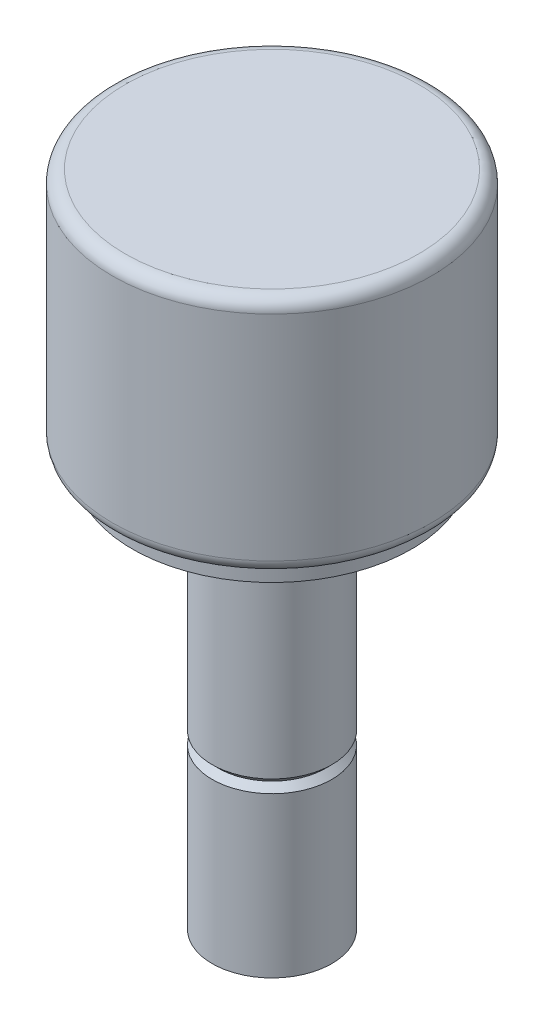
ISO-10303-21;
HEADER;
FILE_DESCRIPTION(('STEP AP214'),'2;1');
FILE_NAME('part.step','',(''),(''),'','','');
FILE_SCHEMA(('AUTOMOTIVE_DESIGN { 1 0 10303 214 1 1 1 1 }'));
ENDSEC;
DATA;
#1=APPLICATION_CONTEXT('core data for automotive mechanical design processes');
#2=APPLICATION_PROTOCOL_DEFINITION('international standard','automotive_design',2000,#1);
#3=PRODUCT_CONTEXT('',#1,'mechanical');
#4=PRODUCT('Part','Part','',(#3));
#5=PRODUCT_RELATED_PRODUCT_CATEGORY('part','',(#4));
#6=PRODUCT_DEFINITION_FORMATION('','',#4);
#7=PRODUCT_DEFINITION_CONTEXT('part definition',#1,'design');
#8=PRODUCT_DEFINITION('design','',#6,#7);
#9=PRODUCT_DEFINITION_SHAPE('','',#8);
#10=(LENGTH_UNIT() NAMED_UNIT(*) SI_UNIT(.MILLI.,.METRE.));
#11=(NAMED_UNIT(*) PLANE_ANGLE_UNIT() SI_UNIT($,.RADIAN.));
#12=(NAMED_UNIT(*) SI_UNIT($,.STERADIAN.) SOLID_ANGLE_UNIT());
#13=UNCERTAINTY_MEASURE_WITH_UNIT(LENGTH_MEASURE(1.E-05),#10,'distance_accuracy_value','');
#14=(GEOMETRIC_REPRESENTATION_CONTEXT(3) GLOBAL_UNCERTAINTY_ASSIGNED_CONTEXT((#13)) GLOBAL_UNIT_ASSIGNED_CONTEXT((#10,
#11,#12)) REPRESENTATION_CONTEXT('',''));
#15=CARTESIAN_POINT('',(0.,0.,0.));
#16=DIRECTION('',(0.,0.,1.));
#17=DIRECTION('',(1.,0.,0.));
#18=AXIS2_PLACEMENT_3D('',#15,#16,#17);
#19=CARTESIAN_POINT('',(0.,0.,0.));
#20=DIRECTION('',(0.,-1.,0.));
#21=DIRECTION('',(0.,0.,-1.));
#22=AXIS2_PLACEMENT_3D('',#19,#20,#21);
#23=PLANE('',#22);
#24=CARTESIAN_POINT('',(0.,0.,0.));
#25=DIRECTION('',(0.,-1.,0.));
#26=DIRECTION('',(0.,0.,-1.));
#27=AXIS2_PLACEMENT_3D('',#24,#25,#26);
#28=CIRCLE('',#27,2.38125);
#29=CARTESIAN_POINT('',(0.,0.,-2.38125));
#30=VERTEX_POINT('',#29);
#31=EDGE_CURVE('E50',#30,#30,#28,.T.);
#32=ORIENTED_EDGE('',*,*,#31,.T.);
#33=EDGE_LOOP('',(#32));
#34=FACE_BOUND('',#33,.T.);
#35=ADVANCED_FACE('F30',(#34),#23,.T.);
#36=CARTESIAN_POINT('',(0.,0.,0.));
#37=DIRECTION('',(0.,-1.,0.));
#38=DIRECTION('',(0.,0.,-1.));
#39=AXIS2_PLACEMENT_3D('',#36,#37,#38);
#40=CYLINDRICAL_SURFACE('',#39,2.38125);
#41=CARTESIAN_POINT('',(0.,6.35,0.));
#42=DIRECTION('',(0.,-1.,0.));
#43=DIRECTION('',(0.,0.,-1.));
#44=AXIS2_PLACEMENT_3D('',#41,#42,#43);
#45=CIRCLE('',#44,2.38125);
#46=CARTESIAN_POINT('',(0.,6.35,-2.38125));
#47=VERTEX_POINT('',#46);
#48=EDGE_CURVE('E53',#47,#47,#45,.T.);
#49=ORIENTED_EDGE('',*,*,#48,.T.);
#50=EDGE_LOOP('',(#49));
#51=FACE_BOUND('',#50,.T.);
#52=ORIENTED_EDGE('',*,*,#31,.F.);
#53=EDGE_LOOP('',(#52));
#54=FACE_BOUND('',#53,.T.);
#55=ADVANCED_FACE('F89',(#51,#54),#40,.T.);
#56=CARTESIAN_POINT('',(0.,6.35,0.));
#57=DIRECTION('',(0.,-1.,0.));
#58=DIRECTION('',(0.,0.,-1.));
#59=AXIS2_PLACEMENT_3D('',#56,#57,#58);
#60=CONICAL_SURFACE('',#59,2.38125,0.785398163397452);
#61=CARTESIAN_POINT('',(0.,6.604,0.));
#62=DIRECTION('',(0.,-1.,0.));
#63=DIRECTION('',(0.,0.,-1.));
#64=AXIS2_PLACEMENT_3D('',#61,#62,#63);
#65=CIRCLE('',#64,2.12725);
#66=CARTESIAN_POINT('',(0.,6.604,-2.12725));
#67=VERTEX_POINT('',#66);
#68=EDGE_CURVE('E56',#67,#67,#65,.T.);
#69=ORIENTED_EDGE('',*,*,#68,.T.);
#70=EDGE_LOOP('',(#69));
#71=FACE_BOUND('',#70,.T.);
#72=ORIENTED_EDGE('',*,*,#48,.F.);
#73=EDGE_LOOP('',(#72));
#74=FACE_BOUND('',#73,.T.);
#75=ADVANCED_FACE('F95',(#71,#74),#60,.T.);
#76=CARTESIAN_POINT('',(0.,6.604,0.));
#77=DIRECTION('',(0.,1.,0.));
#78=DIRECTION('',(0.,0.,1.));
#79=AXIS2_PLACEMENT_3D('',#76,#77,#78);
#80=CONICAL_SURFACE('',#79,2.12725,0.785398163397452);
#81=CARTESIAN_POINT('',(0.,6.858,0.));
#82=DIRECTION('',(0.,-1.,0.));
#83=DIRECTION('',(0.,0.,-1.));
#84=AXIS2_PLACEMENT_3D('',#81,#82,#83);
#85=CIRCLE('',#84,2.38125);
#86=CARTESIAN_POINT('',(0.,6.858,-2.38125));
#87=VERTEX_POINT('',#86);
#88=EDGE_CURVE('E59',#87,#87,#85,.T.);
#89=ORIENTED_EDGE('',*,*,#88,.T.);
#90=EDGE_LOOP('',(#89));
#91=FACE_BOUND('',#90,.T.);
#92=ORIENTED_EDGE('',*,*,#68,.F.);
#93=EDGE_LOOP('',(#92));
#94=FACE_BOUND('',#93,.T.);
#95=ADVANCED_FACE('F145',(#91,#94),#80,.T.);
#96=CARTESIAN_POINT('',(0.,0.,0.));
#97=DIRECTION('',(0.,-1.,0.));
#98=DIRECTION('',(0.,0.,-1.));
#99=AXIS2_PLACEMENT_3D('',#96,#97,#98);
#100=CYLINDRICAL_SURFACE('',#99,2.38125);
#101=CARTESIAN_POINT('',(0.,15.875,0.));
#102=DIRECTION('',(0.,-1.,0.));
#103=DIRECTION('',(0.,0.,-1.));
#104=AXIS2_PLACEMENT_3D('',#101,#102,#103);
#105=CIRCLE('',#104,2.38125);
#106=CARTESIAN_POINT('',(0.,15.875,-2.38125));
#107=VERTEX_POINT('',#106);
#108=EDGE_CURVE('E62',#107,#107,#105,.T.);
#109=ORIENTED_EDGE('',*,*,#108,.T.);
#110=EDGE_LOOP('',(#109));
#111=FACE_BOUND('',#110,.T.);
#112=ORIENTED_EDGE('',*,*,#88,.F.);
#113=EDGE_LOOP('',(#112));
#114=FACE_BOUND('',#113,.T.);
#115=ADVANCED_FACE('F135',(#111,#114),#100,.T.);
#116=CARTESIAN_POINT('',(2.38125,15.875,0.));
#117=DIRECTION('',(0.,-1.,0.));
#118=DIRECTION('',(0.,0.,-1.));
#119=AXIS2_PLACEMENT_3D('',#116,#117,#118);
#120=PLANE('',#119);
#121=CARTESIAN_POINT('',(0.,15.875,0.));
#122=DIRECTION('',(0.,-1.,0.));
#123=DIRECTION('',(0.,0.,-1.));
#124=AXIS2_PLACEMENT_3D('',#121,#122,#123);
#125=CIRCLE('',#124,5.55625);
#126=CARTESIAN_POINT('',(0.,15.875,-5.55625));
#127=VERTEX_POINT('',#126);
#128=EDGE_CURVE('E65',#127,#127,#125,.T.);
#129=ORIENTED_EDGE('',*,*,#128,.T.);
#130=EDGE_LOOP('',(#129));
#131=FACE_BOUND('',#130,.T.);
#132=ORIENTED_EDGE('',*,*,#108,.F.);
#133=EDGE_LOOP('',(#132));
#134=FACE_BOUND('',#133,.T.);
#135=ADVANCED_FACE('F86',(#131,#134),#120,.T.);
#136=CARTESIAN_POINT('',(0.,0.,0.));
#137=DIRECTION('',(0.,-1.,0.));
#138=DIRECTION('',(0.,0.,-1.));
#139=AXIS2_PLACEMENT_3D('',#136,#137,#138);
#140=CYLINDRICAL_SURFACE('',#139,5.55625);
#141=CARTESIAN_POINT('',(0.,16.66875,0.));
#142=DIRECTION('',(0.,-1.,0.));
#143=DIRECTION('',(0.,0.,-1.));
#144=AXIS2_PLACEMENT_3D('',#141,#142,#143);
#145=CIRCLE('',#144,5.55625);
#146=CARTESIAN_POINT('',(0.,16.66875,-5.55625));
#147=VERTEX_POINT('',#146);
#148=EDGE_CURVE('E68',#147,#147,#145,.T.);
#149=ORIENTED_EDGE('',*,*,#148,.T.);
#150=EDGE_LOOP('',(#149));
#151=FACE_BOUND('',#150,.T.);
#152=ORIENTED_EDGE('',*,*,#128,.F.);
#153=EDGE_LOOP('',(#152));
#154=FACE_BOUND('',#153,.T.);
#155=ADVANCED_FACE('F72',(#151,#154),#140,.T.);
#156=CARTESIAN_POINT('',(5.55625,16.66875,0.));
#157=DIRECTION('',(0.,-1.,0.));
#158=DIRECTION('',(0.,0.,-1.));
#159=AXIS2_PLACEMENT_3D('',#156,#157,#158);
#160=PLANE('',#159);
#161=CARTESIAN_POINT('',(0.,16.66875,0.));
#162=DIRECTION('',(0.,-1.,0.));
#163=DIRECTION('',(0.,0.,-1.));
#164=AXIS2_PLACEMENT_3D('',#161,#162,#163);
#165=CIRCLE('',#164,5.842);
#166=CARTESIAN_POINT('',(0.,16.66875,-5.842));
#167=VERTEX_POINT('',#166);
#168=EDGE_CURVE('E45',#167,#167,#165,.T.);
#169=ORIENTED_EDGE('',*,*,#168,.T.);
#170=EDGE_LOOP('',(#169));
#171=FACE_BOUND('',#170,.T.);
#172=ORIENTED_EDGE('',*,*,#148,.F.);
#173=EDGE_LOOP('',(#172));
#174=FACE_BOUND('',#173,.T.);
#175=ADVANCED_FACE('F75',(#171,#174),#160,.T.);
#176=CARTESIAN_POINT('',(0.,0.,0.));
#177=DIRECTION('',(0.,-1.,0.));
#178=DIRECTION('',(0.,0.,-1.));
#179=AXIS2_PLACEMENT_3D('',#176,#177,#178);
#180=CYLINDRICAL_SURFACE('',#179,6.35);
#181=CARTESIAN_POINT('',(0.,17.17675,0.));
#182=DIRECTION('',(0.,-1.,0.));
#183=DIRECTION('',(0.,0.,-1.));
#184=AXIS2_PLACEMENT_3D('',#181,#182,#183);
#185=CIRCLE('',#184,6.35);
#186=CARTESIAN_POINT('',(0.,17.17675,-6.35));
#187=VERTEX_POINT('',#186);
#188=EDGE_CURVE('E37',#187,#187,#185,.F.);
#189=ORIENTED_EDGE('',*,*,#188,.T.);
#190=EDGE_LOOP('',(#189));
#191=FACE_BOUND('',#190,.T.);
#192=CARTESIAN_POINT('',(0.,25.68575,0.));
#193=DIRECTION('',(0.,1.,0.));
#194=DIRECTION('',(0.,0.,1.));
#195=AXIS2_PLACEMENT_3D('',#192,#193,#194);
#196=CIRCLE('',#195,6.35);
#197=CARTESIAN_POINT('',(0.,25.68575,6.35));
#198=VERTEX_POINT('',#197);
#199=EDGE_CURVE('E41',#198,#198,#196,.F.);
#200=ORIENTED_EDGE('',*,*,#199,.T.);
#201=EDGE_LOOP('',(#200));
#202=FACE_BOUND('',#201,.T.);
#203=ADVANCED_FACE('F77',(#191,#202),#180,.T.);
#204=CARTESIAN_POINT('',(6.35,26.19375,0.));
#205=DIRECTION('',(0.,1.,0.));
#206=DIRECTION('',(0.,0.,1.));
#207=AXIS2_PLACEMENT_3D('',#204,#205,#206);
#208=PLANE('',#207);
#209=CARTESIAN_POINT('',(0.,26.19375,0.));
#210=DIRECTION('',(0.,1.,0.));
#211=DIRECTION('',(0.,0.,1.));
#212=AXIS2_PLACEMENT_3D('',#209,#210,#211);
#213=CIRCLE('',#212,5.842);
#214=CARTESIAN_POINT('',(0.,26.19375,5.842));
#215=VERTEX_POINT('',#214);
#216=EDGE_CURVE('E10',#215,#215,#213,.T.);
#217=ORIENTED_EDGE('',*,*,#216,.T.);
#218=EDGE_LOOP('',(#217));
#219=FACE_BOUND('',#218,.T.);
#220=ADVANCED_FACE('F84',(#219),#208,.T.);
#221=CARTESIAN_POINT('',(0.,17.17675,0.));
#222=DIRECTION('',(0.,-1.,0.));
#223=DIRECTION('',(0.,0.,-1.));
#224=AXIS2_PLACEMENT_3D('',#221,#222,#223);
#225=TOROIDAL_SURFACE('',#224,5.842,0.508);
#226=ORIENTED_EDGE('',*,*,#188,.F.);
#227=EDGE_LOOP('',(#226));
#228=FACE_BOUND('',#227,.T.);
#229=ORIENTED_EDGE('',*,*,#168,.F.);
#230=EDGE_LOOP('',(#229));
#231=FACE_BOUND('',#230,.T.);
#232=ADVANCED_FACE('F99',(#228,#231),#225,.T.);
#233=CARTESIAN_POINT('',(0.,25.68575,0.));
#234=DIRECTION('',(0.,1.,0.));
#235=DIRECTION('',(0.,0.,1.));
#236=AXIS2_PLACEMENT_3D('',#233,#234,#235);
#237=TOROIDAL_SURFACE('',#236,5.842,0.508);
#238=ORIENTED_EDGE('',*,*,#216,.F.);
#239=EDGE_LOOP('',(#238));
#240=FACE_BOUND('',#239,.T.);
#241=ORIENTED_EDGE('',*,*,#199,.F.);
#242=EDGE_LOOP('',(#241));
#243=FACE_BOUND('',#242,.T.);
#244=ADVANCED_FACE('F32',(#240,#243),#237,.T.);
#245=CLOSED_SHELL('',(#35,#55,#75,#95,#115,#135,#155,#175,#203,#220,#232,#244));
#246=MANIFOLD_SOLID_BREP('B2',#245);
#247=ADVANCED_BREP_SHAPE_REPRESENTATION('',(#18,#246),#14);
#248=SHAPE_DEFINITION_REPRESENTATION(#9,#247);
ENDSEC;
END-ISO-10303-21;
